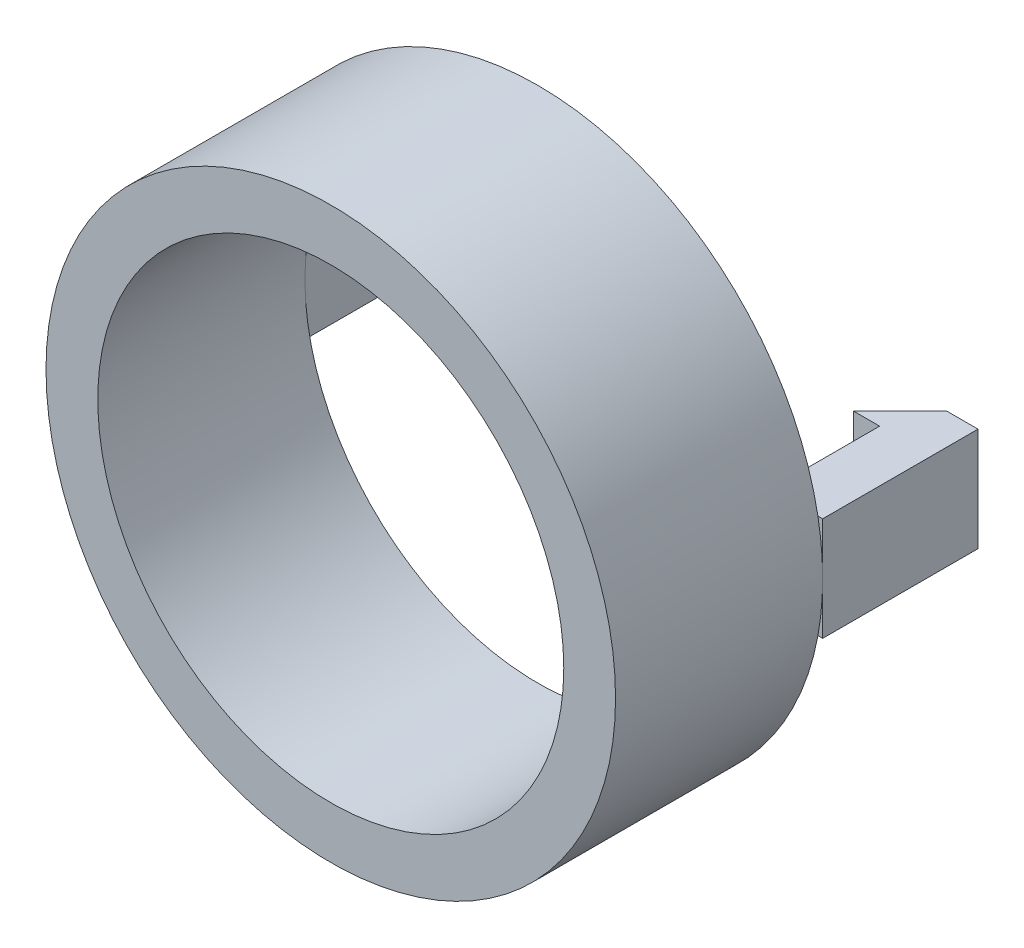
ISO-10303-21;
HEADER;
FILE_DESCRIPTION(('STEP AP214'),'2;1');
FILE_NAME('part.step','',(''),(''),'','','');
FILE_SCHEMA(('AUTOMOTIVE_DESIGN { 1 0 10303 214 1 1 1 1 }'));
ENDSEC;
DATA;
#1=APPLICATION_CONTEXT('core data for automotive mechanical design processes');
#2=APPLICATION_PROTOCOL_DEFINITION('international standard','automotive_design',2000,#1);
#3=PRODUCT_CONTEXT('',#1,'mechanical');
#4=PRODUCT('Part','Part','',(#3));
#5=PRODUCT_RELATED_PRODUCT_CATEGORY('part','',(#4));
#6=PRODUCT_DEFINITION_FORMATION('','',#4);
#7=PRODUCT_DEFINITION_CONTEXT('part definition',#1,'design');
#8=PRODUCT_DEFINITION('design','',#6,#7);
#9=PRODUCT_DEFINITION_SHAPE('','',#8);
#10=(LENGTH_UNIT() NAMED_UNIT(*) SI_UNIT(.MILLI.,.METRE.));
#11=(NAMED_UNIT(*) PLANE_ANGLE_UNIT() SI_UNIT($,.RADIAN.));
#12=(NAMED_UNIT(*) SI_UNIT($,.STERADIAN.) SOLID_ANGLE_UNIT());
#13=UNCERTAINTY_MEASURE_WITH_UNIT(LENGTH_MEASURE(1.E-05),#10,'distance_accuracy_value','');
#14=(GEOMETRIC_REPRESENTATION_CONTEXT(3) GLOBAL_UNCERTAINTY_ASSIGNED_CONTEXT((#13)) GLOBAL_UNIT_ASSIGNED_CONTEXT((#10,
#11,#12)) REPRESENTATION_CONTEXT('',''));
#15=CARTESIAN_POINT('',(0.,0.,0.));
#16=DIRECTION('',(0.,0.,1.));
#17=DIRECTION('',(1.,0.,0.));
#18=AXIS2_PLACEMENT_3D('',#15,#16,#17);
#19=CARTESIAN_POINT('',(0.,0.,0.));
#20=DIRECTION('',(0.,0.,1.));
#21=DIRECTION('',(1.,0.,0.));
#22=AXIS2_PLACEMENT_3D('',#19,#20,#21);
#23=PLANE('',#22);
#24=DIRECTION('',(0.,-1.,0.));
#25=VECTOR('',#24,1.);
#26=CARTESIAN_POINT('',(9.,2.,0.));
#27=LINE('',#26,#25);
#28=CARTESIAN_POINT('',(9.,0.,0.));
#29=VERTEX_POINT('',#28);
#30=CARTESIAN_POINT('',(9.,-2.,0.));
#31=VERTEX_POINT('',#30);
#32=EDGE_CURVE('E176',#29,#31,#27,.T.);
#33=ORIENTED_EDGE('',*,*,#32,.T.);
#34=DIRECTION('',(1.,0.,0.));
#35=VECTOR('',#34,1.);
#36=CARTESIAN_POINT('',(9.,-2.,0.));
#37=LINE('',#36,#35);
#38=CARTESIAN_POINT('',(10.816653826392,-2.,0.));
#39=VERTEX_POINT('',#38);
#40=EDGE_CURVE('E206',#31,#39,#37,.T.);
#41=ORIENTED_EDGE('',*,*,#40,.T.);
#42=CARTESIAN_POINT('',(0.,0.,0.));
#43=DIRECTION('',(0.,0.,1.));
#44=DIRECTION('',(1.,0.,0.));
#45=AXIS2_PLACEMENT_3D('',#42,#43,#44);
#46=CIRCLE('',#45,11.);
#47=CARTESIAN_POINT('',(-10.816653826392,-2.,0.));
#48=VERTEX_POINT('',#47);
#49=EDGE_CURVE('E326',#48,#39,#46,.T.);
#50=ORIENTED_EDGE('',*,*,#49,.F.);
#51=DIRECTION('',(1.,0.,0.));
#52=VECTOR('',#51,1.);
#53=CARTESIAN_POINT('',(-9.,-2.,0.));
#54=LINE('',#53,#52);
#55=CARTESIAN_POINT('',(-9.,-2.,0.));
#56=VERTEX_POINT('',#55);
#57=EDGE_CURVE('E11',#48,#56,#54,.T.);
#58=ORIENTED_EDGE('',*,*,#57,.T.);
#59=DIRECTION('',(0.,-1.,0.));
#60=VECTOR('',#59,1.);
#61=CARTESIAN_POINT('',(-9.,2.,0.));
#62=LINE('',#61,#60);
#63=CARTESIAN_POINT('',(-9.,0.,0.));
#64=VERTEX_POINT('',#63);
#65=EDGE_CURVE('E49',#64,#56,#62,.T.);
#66=ORIENTED_EDGE('',*,*,#65,.F.);
#67=CARTESIAN_POINT('',(0.,0.,0.));
#68=DIRECTION('',(0.,0.,1.));
#69=DIRECTION('',(1.,0.,0.));
#70=AXIS2_PLACEMENT_3D('',#67,#68,#69);
#71=CIRCLE('',#70,9.);
#72=EDGE_CURVE('E309',#64,#29,#71,.T.);
#73=ORIENTED_EDGE('',*,*,#72,.T.);
#74=EDGE_LOOP('',(#33,#41,#50,#58,#66,#73));
#75=FACE_BOUND('',#74,.T.);
#76=ADVANCED_FACE('F39',(#75),#23,.F.);
#77=CARTESIAN_POINT('',(0.,0.,8.));
#78=DIRECTION('',(0.,0.,1.));
#79=DIRECTION('',(1.,0.,0.));
#80=AXIS2_PLACEMENT_3D('',#77,#78,#79);
#81=PLANE('',#80);
#82=CARTESIAN_POINT('',(0.,0.,8.));
#83=DIRECTION('',(0.,0.,1.));
#84=DIRECTION('',(1.,0.,0.));
#85=AXIS2_PLACEMENT_3D('',#82,#83,#84);
#86=CIRCLE('',#85,11.);
#87=CARTESIAN_POINT('',(11.,0.,8.));
#88=VERTEX_POINT('',#87);
#89=EDGE_CURVE('E312',#88,#88,#86,.T.);
#90=ORIENTED_EDGE('',*,*,#89,.T.);
#91=EDGE_LOOP('',(#90));
#92=FACE_BOUND('',#91,.T.);
#93=CARTESIAN_POINT('',(0.,0.,8.));
#94=DIRECTION('',(0.,0.,1.));
#95=DIRECTION('',(1.,0.,0.));
#96=AXIS2_PLACEMENT_3D('',#93,#94,#95);
#97=CIRCLE('',#96,9.);
#98=CARTESIAN_POINT('',(9.,0.,8.));
#99=VERTEX_POINT('',#98);
#100=EDGE_CURVE('E305',#99,#99,#97,.T.);
#101=ORIENTED_EDGE('',*,*,#100,.F.);
#102=EDGE_LOOP('',(#101));
#103=FACE_BOUND('',#102,.T.);
#104=ADVANCED_FACE('F370',(#92,#103),#81,.T.);
#105=CARTESIAN_POINT('',(10.816653826392,2.,0.));
#106=VERTEX_POINT('',#105);
#107=CARTESIAN_POINT('',(-10.816653826392,2.,0.));
#108=VERTEX_POINT('',#107);
#109=EDGE_CURVE('E184',#106,#108,#46,.T.);
#110=ORIENTED_EDGE('',*,*,#109,.F.);
#111=DIRECTION('',(1.,0.,0.));
#112=VECTOR('',#111,1.);
#113=CARTESIAN_POINT('',(9.,2.,0.));
#114=LINE('',#113,#112);
#115=CARTESIAN_POINT('',(9.,2.,0.));
#116=VERTEX_POINT('',#115);
#117=EDGE_CURVE('E160',#116,#106,#114,.T.);
#118=ORIENTED_EDGE('',*,*,#117,.F.);
#119=EDGE_CURVE('E172',#116,#29,#27,.T.);
#120=ORIENTED_EDGE('',*,*,#119,.T.);
#121=EDGE_CURVE('E304',#29,#64,#71,.T.);
#122=ORIENTED_EDGE('',*,*,#121,.T.);
#123=CARTESIAN_POINT('',(-9.,2.,0.));
#124=VERTEX_POINT('',#123);
#125=EDGE_CURVE('E300',#124,#64,#62,.T.);
#126=ORIENTED_EDGE('',*,*,#125,.F.);
#127=DIRECTION('',(1.,0.,0.));
#128=VECTOR('',#127,1.);
#129=CARTESIAN_POINT('',(-9.,2.,0.));
#130=LINE('',#129,#128);
#131=EDGE_CURVE('E247',#108,#124,#130,.T.);
#132=ORIENTED_EDGE('',*,*,#131,.F.);
#133=EDGE_LOOP('',(#110,#118,#120,#122,#126,#132));
#134=FACE_BOUND('',#133,.T.);
#135=ADVANCED_FACE('F182',(#134),#23,.F.);
#136=CARTESIAN_POINT('',(0.,0.,8.));
#137=DIRECTION('',(0.,0.,-1.));
#138=DIRECTION('',(-1.,0.,0.));
#139=AXIS2_PLACEMENT_3D('',#136,#137,#138);
#140=CYLINDRICAL_SURFACE('',#139,11.);
#141=ORIENTED_EDGE('',*,*,#89,.F.);
#142=EDGE_LOOP('',(#141));
#143=FACE_BOUND('',#142,.T.);
#144=CARTESIAN_POINT('',(-11.,0.,0.));
#145=VERTEX_POINT('',#144);
#146=EDGE_CURVE('E43',#108,#145,#46,.T.);
#147=ORIENTED_EDGE('',*,*,#146,.T.);
#148=EDGE_CURVE('E320',#145,#48,#46,.T.);
#149=ORIENTED_EDGE('',*,*,#148,.T.);
#150=ORIENTED_EDGE('',*,*,#49,.T.);
#151=CARTESIAN_POINT('',(0.,0.,0.));
#152=DIRECTION('',(0.,0.,-1.));
#153=DIRECTION('',(-1.,0.,0.));
#154=AXIS2_PLACEMENT_3D('',#151,#152,#153);
#155=CIRCLE('',#154,11.);
#156=CARTESIAN_POINT('',(11.,0.,0.));
#157=VERTEX_POINT('',#156);
#158=EDGE_CURVE('E180',#157,#39,#155,.T.);
#159=ORIENTED_EDGE('',*,*,#158,.F.);
#160=EDGE_CURVE('E240',#106,#157,#155,.T.);
#161=ORIENTED_EDGE('',*,*,#160,.F.);
#162=ORIENTED_EDGE('',*,*,#109,.T.);
#163=EDGE_LOOP('',(#147,#149,#150,#159,#161,#162));
#164=FACE_BOUND('',#163,.T.);
#165=ADVANCED_FACE('F41',(#143,#164),#140,.T.);
#166=CARTESIAN_POINT('',(0.,0.,8.));
#167=DIRECTION('',(0.,0.,-1.));
#168=DIRECTION('',(-1.,0.,0.));
#169=AXIS2_PLACEMENT_3D('',#166,#167,#168);
#170=CYLINDRICAL_SURFACE('',#169,9.);
#171=ORIENTED_EDGE('',*,*,#100,.T.);
#172=EDGE_LOOP('',(#171));
#173=FACE_BOUND('',#172,.T.);
#174=ORIENTED_EDGE('',*,*,#72,.F.);
#175=ORIENTED_EDGE('',*,*,#121,.F.);
#176=EDGE_LOOP('',(#174,#175));
#177=FACE_BOUND('',#176,.T.);
#178=ADVANCED_FACE('F379',(#173,#177),#170,.F.);
#179=CARTESIAN_POINT('',(-9.,2.,0.));
#180=DIRECTION('',(0.,0.,-1.));
#181=DIRECTION('',(-1.,0.,0.));
#182=AXIS2_PLACEMENT_3D('',#179,#180,#181);
#183=PLANE('',#182);
#184=ORIENTED_EDGE('',*,*,#146,.F.);
#185=CARTESIAN_POINT('',(-11.,2.,0.));
#186=VERTEX_POINT('',#185);
#187=EDGE_CURVE('E241',#186,#108,#130,.T.);
#188=ORIENTED_EDGE('',*,*,#187,.F.);
#189=DIRECTION('',(0.,-1.,0.));
#190=VECTOR('',#189,1.);
#191=CARTESIAN_POINT('',(-11.,2.,0.));
#192=LINE('',#191,#190);
#193=EDGE_CURVE('E280',#186,#145,#192,.T.);
#194=ORIENTED_EDGE('',*,*,#193,.T.);
#195=EDGE_LOOP('',(#184,#188,#194));
#196=FACE_BOUND('',#195,.T.);
#197=ADVANCED_FACE('F384',(#196),#183,.F.);
#198=ORIENTED_EDGE('',*,*,#148,.F.);
#199=CARTESIAN_POINT('',(-11.,-2.,0.));
#200=VERTEX_POINT('',#199);
#201=EDGE_CURVE('E261',#145,#200,#192,.T.);
#202=ORIENTED_EDGE('',*,*,#201,.T.);
#203=EDGE_CURVE('E51',#200,#48,#54,.T.);
#204=ORIENTED_EDGE('',*,*,#203,.T.);
#205=EDGE_LOOP('',(#198,#202,#204));
#206=FACE_BOUND('',#205,.T.);
#207=ADVANCED_FACE('F390',(#206),#183,.F.);
#208=CARTESIAN_POINT('',(-9.,2.,-4.2));
#209=DIRECTION('',(-1.,0.,0.));
#210=DIRECTION('',(0.,0.,1.));
#211=AXIS2_PLACEMENT_3D('',#208,#209,#210);
#212=PLANE('',#211);
#213=DIRECTION('',(0.,0.,-1.));
#214=VECTOR('',#213,1.);
#215=CARTESIAN_POINT('',(-9.,-2.,-4.2));
#216=LINE('',#215,#214);
#217=CARTESIAN_POINT('',(-9.,-2.,-4.2));
#218=VERTEX_POINT('',#217);
#219=EDGE_CURVE('E265',#56,#218,#216,.T.);
#220=ORIENTED_EDGE('',*,*,#219,.T.);
#221=DIRECTION('',(0.,-1.,0.));
#222=VECTOR('',#221,1.);
#223=CARTESIAN_POINT('',(-9.,2.,-4.2));
#224=LINE('',#223,#222);
#225=CARTESIAN_POINT('',(-9.,2.,-4.2));
#226=VERTEX_POINT('',#225);
#227=EDGE_CURVE('E296',#226,#218,#224,.T.);
#228=ORIENTED_EDGE('',*,*,#227,.F.);
#229=DIRECTION('',(0.,0.,-1.));
#230=VECTOR('',#229,1.);
#231=CARTESIAN_POINT('',(-9.,2.,-4.2));
#232=LINE('',#231,#230);
#233=EDGE_CURVE('E245',#124,#226,#232,.T.);
#234=ORIENTED_EDGE('',*,*,#233,.F.);
#235=ORIENTED_EDGE('',*,*,#125,.T.);
#236=ORIENTED_EDGE('',*,*,#65,.T.);
#237=EDGE_LOOP('',(#220,#228,#234,#235,#236));
#238=FACE_BOUND('',#237,.T.);
#239=ADVANCED_FACE('F396',(#238),#212,.F.);
#240=CARTESIAN_POINT('',(-8.,2.,-4.2));
#241=DIRECTION('',(0.,0.,-1.));
#242=DIRECTION('',(-1.,0.,0.));
#243=AXIS2_PLACEMENT_3D('',#240,#241,#242);
#244=PLANE('',#243);
#245=DIRECTION('',(1.,0.,0.));
#246=VECTOR('',#245,1.);
#247=CARTESIAN_POINT('',(-8.,-2.,-4.2));
#248=LINE('',#247,#246);
#249=CARTESIAN_POINT('',(-8.,-2.,-4.2));
#250=VERTEX_POINT('',#249);
#251=EDGE_CURVE('E268',#218,#250,#248,.T.);
#252=ORIENTED_EDGE('',*,*,#251,.T.);
#253=DIRECTION('',(0.,-1.,0.));
#254=VECTOR('',#253,1.);
#255=CARTESIAN_POINT('',(-8.,2.,-4.2));
#256=LINE('',#255,#254);
#257=CARTESIAN_POINT('',(-8.,2.,-4.2));
#258=VERTEX_POINT('',#257);
#259=EDGE_CURVE('E292',#258,#250,#256,.T.);
#260=ORIENTED_EDGE('',*,*,#259,.F.);
#261=DIRECTION('',(1.,0.,0.));
#262=VECTOR('',#261,1.);
#263=CARTESIAN_POINT('',(-8.,2.,-4.2));
#264=LINE('',#263,#262);
#265=EDGE_CURVE('E250',#226,#258,#264,.T.);
#266=ORIENTED_EDGE('',*,*,#265,.F.);
#267=ORIENTED_EDGE('',*,*,#227,.T.);
#268=EDGE_LOOP('',(#252,#260,#266,#267));
#269=FACE_BOUND('',#268,.T.);
#270=ADVANCED_FACE('F400',(#269),#244,.F.);
#271=CARTESIAN_POINT('',(-9.80000000000002,2.,-6.));
#272=DIRECTION('',(-0.707106781186543,0.,0.707106781186552));
#273=DIRECTION('',(0.707106781186552,0.,0.707106781186543));
#274=AXIS2_PLACEMENT_3D('',#271,#272,#273);
#275=PLANE('',#274);
#276=DIRECTION('',(-0.707106781186552,0.,-0.707106781186543));
#277=VECTOR('',#276,1.);
#278=CARTESIAN_POINT('',(-9.80000000000002,-2.,-6.));
#279=LINE('',#278,#277);
#280=CARTESIAN_POINT('',(-9.80000000000002,-2.,-6.));
#281=VERTEX_POINT('',#280);
#282=EDGE_CURVE('E271',#250,#281,#279,.T.);
#283=ORIENTED_EDGE('',*,*,#282,.T.);
#284=DIRECTION('',(0.,-1.,0.));
#285=VECTOR('',#284,1.);
#286=CARTESIAN_POINT('',(-9.80000000000002,2.,-6.));
#287=LINE('',#286,#285);
#288=CARTESIAN_POINT('',(-9.80000000000002,2.,-6.));
#289=VERTEX_POINT('',#288);
#290=EDGE_CURVE('E288',#289,#281,#287,.T.);
#291=ORIENTED_EDGE('',*,*,#290,.F.);
#292=DIRECTION('',(-0.707106781186552,0.,-0.707106781186543));
#293=VECTOR('',#292,1.);
#294=CARTESIAN_POINT('',(-9.80000000000002,2.,-6.));
#295=LINE('',#294,#293);
#296=EDGE_CURVE('E253',#258,#289,#295,.T.);
#297=ORIENTED_EDGE('',*,*,#296,.F.);
#298=ORIENTED_EDGE('',*,*,#259,.T.);
#299=EDGE_LOOP('',(#283,#291,#297,#298));
#300=FACE_BOUND('',#299,.T.);
#301=ADVANCED_FACE('F404',(#300),#275,.F.);
#302=CARTESIAN_POINT('',(-11.,2.,-6.));
#303=DIRECTION('',(0.,0.,1.));
#304=DIRECTION('',(1.,0.,0.));
#305=AXIS2_PLACEMENT_3D('',#302,#303,#304);
#306=PLANE('',#305);
#307=DIRECTION('',(-1.,0.,0.));
#308=VECTOR('',#307,1.);
#309=CARTESIAN_POINT('',(-11.,-2.,-6.));
#310=LINE('',#309,#308);
#311=CARTESIAN_POINT('',(-11.,-2.,-6.));
#312=VERTEX_POINT('',#311);
#313=EDGE_CURVE('E274',#281,#312,#310,.T.);
#314=ORIENTED_EDGE('',*,*,#313,.T.);
#315=DIRECTION('',(0.,-1.,0.));
#316=VECTOR('',#315,1.);
#317=CARTESIAN_POINT('',(-11.,2.,-6.));
#318=LINE('',#317,#316);
#319=CARTESIAN_POINT('',(-11.,2.,-6.));
#320=VERTEX_POINT('',#319);
#321=EDGE_CURVE('E284',#320,#312,#318,.T.);
#322=ORIENTED_EDGE('',*,*,#321,.F.);
#323=DIRECTION('',(-1.,0.,0.));
#324=VECTOR('',#323,1.);
#325=CARTESIAN_POINT('',(-11.,2.,-6.));
#326=LINE('',#325,#324);
#327=EDGE_CURVE('E256',#289,#320,#326,.T.);
#328=ORIENTED_EDGE('',*,*,#327,.F.);
#329=ORIENTED_EDGE('',*,*,#290,.T.);
#330=EDGE_LOOP('',(#314,#322,#328,#329));
#331=FACE_BOUND('',#330,.T.);
#332=ADVANCED_FACE('F408',(#331),#306,.F.);
#333=CARTESIAN_POINT('',(-11.,2.,0.));
#334=DIRECTION('',(1.,0.,0.));
#335=DIRECTION('',(0.,0.,-1.));
#336=AXIS2_PLACEMENT_3D('',#333,#334,#335);
#337=PLANE('',#336);
#338=DIRECTION('',(0.,0.,1.));
#339=VECTOR('',#338,1.);
#340=CARTESIAN_POINT('',(-11.,-2.,0.));
#341=LINE('',#340,#339);
#342=EDGE_CURVE('E246',#312,#200,#341,.T.);
#343=ORIENTED_EDGE('',*,*,#342,.T.);
#344=ORIENTED_EDGE('',*,*,#201,.F.);
#345=ORIENTED_EDGE('',*,*,#193,.F.);
#346=DIRECTION('',(0.,0.,1.));
#347=VECTOR('',#346,1.);
#348=CARTESIAN_POINT('',(-11.,2.,0.));
#349=LINE('',#348,#347);
#350=EDGE_CURVE('E259',#320,#186,#349,.T.);
#351=ORIENTED_EDGE('',*,*,#350,.F.);
#352=ORIENTED_EDGE('',*,*,#321,.T.);
#353=EDGE_LOOP('',(#343,#344,#345,#351,#352));
#354=FACE_BOUND('',#353,.T.);
#355=ADVANCED_FACE('F412',(#354),#337,.F.);
#356=CARTESIAN_POINT('',(0.,2.,0.));
#357=DIRECTION('',(0.,-1.,0.));
#358=DIRECTION('',(0.,0.,-1.));
#359=AXIS2_PLACEMENT_3D('',#356,#357,#358);
#360=PLANE('',#359);
#361=ORIENTED_EDGE('',*,*,#187,.T.);
#362=ORIENTED_EDGE('',*,*,#131,.T.);
#363=ORIENTED_EDGE('',*,*,#233,.T.);
#364=ORIENTED_EDGE('',*,*,#265,.T.);
#365=ORIENTED_EDGE('',*,*,#296,.T.);
#366=ORIENTED_EDGE('',*,*,#327,.T.);
#367=ORIENTED_EDGE('',*,*,#350,.T.);
#368=EDGE_LOOP('',(#361,#362,#363,#364,#365,#366,#367));
#369=FACE_BOUND('',#368,.T.);
#370=ADVANCED_FACE('F416',(#369),#360,.F.);
#371=CARTESIAN_POINT('',(0.,-2.,0.));
#372=DIRECTION('',(0.,-1.,0.));
#373=DIRECTION('',(0.,0.,-1.));
#374=AXIS2_PLACEMENT_3D('',#371,#372,#373);
#375=PLANE('',#374);
#376=ORIENTED_EDGE('',*,*,#203,.F.);
#377=ORIENTED_EDGE('',*,*,#342,.F.);
#378=ORIENTED_EDGE('',*,*,#313,.F.);
#379=ORIENTED_EDGE('',*,*,#282,.F.);
#380=ORIENTED_EDGE('',*,*,#251,.F.);
#381=ORIENTED_EDGE('',*,*,#219,.F.);
#382=ORIENTED_EDGE('',*,*,#57,.F.);
#383=EDGE_LOOP('',(#376,#377,#378,#379,#380,#381,#382));
#384=FACE_BOUND('',#383,.T.);
#385=ADVANCED_FACE('F367',(#384),#375,.T.);
#386=CARTESIAN_POINT('',(9.,2.,0.));
#387=DIRECTION('',(0.,0.,-1.));
#388=DIRECTION('',(-1.,0.,0.));
#389=AXIS2_PLACEMENT_3D('',#386,#387,#388);
#390=PLANE('',#389);
#391=CARTESIAN_POINT('',(11.,2.,0.));
#392=VERTEX_POINT('',#391);
#393=EDGE_CURVE('E168',#106,#392,#114,.T.);
#394=ORIENTED_EDGE('',*,*,#393,.F.);
#395=ORIENTED_EDGE('',*,*,#160,.T.);
#396=DIRECTION('',(0.,-1.,0.));
#397=VECTOR('',#396,1.);
#398=CARTESIAN_POINT('',(11.,2.,0.));
#399=LINE('',#398,#397);
#400=EDGE_CURVE('E58',#392,#157,#399,.T.);
#401=ORIENTED_EDGE('',*,*,#400,.F.);
#402=EDGE_LOOP('',(#394,#395,#401));
#403=FACE_BOUND('',#402,.T.);
#404=ADVANCED_FACE('F359',(#403),#390,.F.);
#405=CARTESIAN_POINT('',(9.,2.,-4.2));
#406=DIRECTION('',(1.,0.,0.));
#407=DIRECTION('',(0.,0.,-1.));
#408=AXIS2_PLACEMENT_3D('',#405,#406,#407);
#409=PLANE('',#408);
#410=DIRECTION('',(0.,0.,1.));
#411=VECTOR('',#410,1.);
#412=CARTESIAN_POINT('',(9.,-2.,-4.2));
#413=LINE('',#412,#411);
#414=CARTESIAN_POINT('',(9.,-2.,-4.2));
#415=VERTEX_POINT('',#414);
#416=EDGE_CURVE('E202',#415,#31,#413,.T.);
#417=ORIENTED_EDGE('',*,*,#416,.T.);
#418=ORIENTED_EDGE('',*,*,#32,.F.);
#419=ORIENTED_EDGE('',*,*,#119,.F.);
#420=DIRECTION('',(0.,0.,1.));
#421=VECTOR('',#420,1.);
#422=CARTESIAN_POINT('',(9.,2.,-4.2));
#423=LINE('',#422,#421);
#424=CARTESIAN_POINT('',(9.,2.,-4.2));
#425=VERTEX_POINT('',#424);
#426=EDGE_CURVE('E156',#425,#116,#423,.T.);
#427=ORIENTED_EDGE('',*,*,#426,.F.);
#428=DIRECTION('',(0.,-1.,0.));
#429=VECTOR('',#428,1.);
#430=CARTESIAN_POINT('',(9.,2.,-4.2));
#431=LINE('',#430,#429);
#432=EDGE_CURVE('E201',#425,#415,#431,.T.);
#433=ORIENTED_EDGE('',*,*,#432,.T.);
#434=EDGE_LOOP('',(#417,#418,#419,#427,#433));
#435=FACE_BOUND('',#434,.T.);
#436=ADVANCED_FACE('F174',(#435),#409,.F.);
#437=CARTESIAN_POINT('',(11.,-2.,0.));
#438=VERTEX_POINT('',#437);
#439=EDGE_CURVE('E235',#157,#438,#399,.T.);
#440=ORIENTED_EDGE('',*,*,#439,.F.);
#441=ORIENTED_EDGE('',*,*,#158,.T.);
#442=EDGE_CURVE('E205',#39,#438,#37,.T.);
#443=ORIENTED_EDGE('',*,*,#442,.T.);
#444=EDGE_LOOP('',(#440,#441,#443));
#445=FACE_BOUND('',#444,.T.);
#446=ADVANCED_FACE('F355',(#445),#390,.F.);
#447=CARTESIAN_POINT('',(11.,2.,0.));
#448=DIRECTION('',(-1.,0.,0.));
#449=DIRECTION('',(0.,0.,1.));
#450=AXIS2_PLACEMENT_3D('',#447,#448,#449);
#451=PLANE('',#450);
#452=DIRECTION('',(0.,0.,-1.));
#453=VECTOR('',#452,1.);
#454=CARTESIAN_POINT('',(11.,-2.,0.));
#455=LINE('',#454,#453);
#456=CARTESIAN_POINT('',(11.,-2.,-6.));
#457=VERTEX_POINT('',#456);
#458=EDGE_CURVE('E210',#438,#457,#455,.T.);
#459=ORIENTED_EDGE('',*,*,#458,.T.);
#460=DIRECTION('',(0.,-1.,0.));
#461=VECTOR('',#460,1.);
#462=CARTESIAN_POINT('',(11.,2.,-6.));
#463=LINE('',#462,#461);
#464=CARTESIAN_POINT('',(11.,2.,-6.));
#465=VERTEX_POINT('',#464);
#466=EDGE_CURVE('E231',#465,#457,#463,.T.);
#467=ORIENTED_EDGE('',*,*,#466,.F.);
#468=DIRECTION('',(0.,0.,-1.));
#469=VECTOR('',#468,1.);
#470=CARTESIAN_POINT('',(11.,2.,0.));
#471=LINE('',#470,#469);
#472=EDGE_CURVE('E187',#392,#465,#471,.T.);
#473=ORIENTED_EDGE('',*,*,#472,.F.);
#474=ORIENTED_EDGE('',*,*,#400,.T.);
#475=ORIENTED_EDGE('',*,*,#439,.T.);
#476=EDGE_LOOP('',(#459,#467,#473,#474,#475));
#477=FACE_BOUND('',#476,.T.);
#478=ADVANCED_FACE('F351',(#477),#451,.F.);
#479=CARTESIAN_POINT('',(11.,2.,-6.));
#480=DIRECTION('',(0.,0.,1.));
#481=DIRECTION('',(1.,0.,0.));
#482=AXIS2_PLACEMENT_3D('',#479,#480,#481);
#483=PLANE('',#482);
#484=DIRECTION('',(-1.,0.,0.));
#485=VECTOR('',#484,1.);
#486=CARTESIAN_POINT('',(11.,-2.,-6.));
#487=LINE('',#486,#485);
#488=CARTESIAN_POINT('',(9.80000000000002,-2.,-6.));
#489=VERTEX_POINT('',#488);
#490=EDGE_CURVE('E213',#457,#489,#487,.T.);
#491=ORIENTED_EDGE('',*,*,#490,.T.);
#492=DIRECTION('',(0.,-1.,0.));
#493=VECTOR('',#492,1.);
#494=CARTESIAN_POINT('',(9.80000000000002,2.,-6.));
#495=LINE('',#494,#493);
#496=CARTESIAN_POINT('',(9.80000000000002,2.,-6.));
#497=VERTEX_POINT('',#496);
#498=EDGE_CURVE('E227',#497,#489,#495,.T.);
#499=ORIENTED_EDGE('',*,*,#498,.F.);
#500=DIRECTION('',(-1.,0.,0.));
#501=VECTOR('',#500,1.);
#502=CARTESIAN_POINT('',(11.,2.,-6.));
#503=LINE('',#502,#501);
#504=EDGE_CURVE('E191',#465,#497,#503,.T.);
#505=ORIENTED_EDGE('',*,*,#504,.F.);
#506=ORIENTED_EDGE('',*,*,#466,.T.);
#507=EDGE_LOOP('',(#491,#499,#505,#506));
#508=FACE_BOUND('',#507,.T.);
#509=ADVANCED_FACE('F349',(#508),#483,.F.);
#510=CARTESIAN_POINT('',(9.80000000000002,2.,-6.));
#511=DIRECTION('',(0.707106781186543,0.,0.707106781186552));
#512=DIRECTION('',(0.707106781186552,0.,-0.707106781186543));
#513=AXIS2_PLACEMENT_3D('',#510,#511,#512);
#514=PLANE('',#513);
#515=DIRECTION('',(-0.707106781186552,0.,0.707106781186543));
#516=VECTOR('',#515,1.);
#517=CARTESIAN_POINT('',(9.80000000000002,-2.,-6.));
#518=LINE('',#517,#516);
#519=CARTESIAN_POINT('',(8.,-2.,-4.2));
#520=VERTEX_POINT('',#519);
#521=EDGE_CURVE('E216',#489,#520,#518,.T.);
#522=ORIENTED_EDGE('',*,*,#521,.T.);
#523=DIRECTION('',(0.,-1.,0.));
#524=VECTOR('',#523,1.);
#525=CARTESIAN_POINT('',(8.,2.,-4.2));
#526=LINE('',#525,#524);
#527=CARTESIAN_POINT('',(8.,2.,-4.2));
#528=VERTEX_POINT('',#527);
#529=EDGE_CURVE('E223',#528,#520,#526,.T.);
#530=ORIENTED_EDGE('',*,*,#529,.F.);
#531=DIRECTION('',(-0.707106781186552,0.,0.707106781186543));
#532=VECTOR('',#531,1.);
#533=CARTESIAN_POINT('',(9.80000000000002,2.,-6.));
#534=LINE('',#533,#532);
#535=EDGE_CURVE('E196',#497,#528,#534,.T.);
#536=ORIENTED_EDGE('',*,*,#535,.F.);
#537=ORIENTED_EDGE('',*,*,#498,.T.);
#538=EDGE_LOOP('',(#522,#530,#536,#537));
#539=FACE_BOUND('',#538,.T.);
#540=ADVANCED_FACE('F344',(#539),#514,.F.);
#541=CARTESIAN_POINT('',(8.,2.,-4.2));
#542=DIRECTION('',(0.,0.,-1.));
#543=DIRECTION('',(-1.,0.,0.));
#544=AXIS2_PLACEMENT_3D('',#541,#542,#543);
#545=PLANE('',#544);
#546=DIRECTION('',(1.,0.,0.));
#547=VECTOR('',#546,1.);
#548=CARTESIAN_POINT('',(8.,-2.,-4.2));
#549=LINE('',#548,#547);
#550=EDGE_CURVE('E169',#520,#415,#549,.T.);
#551=ORIENTED_EDGE('',*,*,#550,.T.);
#552=ORIENTED_EDGE('',*,*,#432,.F.);
#553=DIRECTION('',(1.,0.,0.));
#554=VECTOR('',#553,1.);
#555=CARTESIAN_POINT('',(8.,2.,-4.2));
#556=LINE('',#555,#554);
#557=EDGE_CURVE('E163',#528,#425,#556,.T.);
#558=ORIENTED_EDGE('',*,*,#557,.F.);
#559=ORIENTED_EDGE('',*,*,#529,.T.);
#560=EDGE_LOOP('',(#551,#552,#558,#559));
#561=FACE_BOUND('',#560,.T.);
#562=ADVANCED_FACE('F339',(#561),#545,.F.);
#563=CARTESIAN_POINT('',(0.,2.,0.));
#564=DIRECTION('',(0.,1.,0.));
#565=DIRECTION('',(0.,0.,1.));
#566=AXIS2_PLACEMENT_3D('',#563,#564,#565);
#567=PLANE('',#566);
#568=ORIENTED_EDGE('',*,*,#426,.T.);
#569=ORIENTED_EDGE('',*,*,#117,.T.);
#570=ORIENTED_EDGE('',*,*,#393,.T.);
#571=ORIENTED_EDGE('',*,*,#472,.T.);
#572=ORIENTED_EDGE('',*,*,#504,.T.);
#573=ORIENTED_EDGE('',*,*,#535,.T.);
#574=ORIENTED_EDGE('',*,*,#557,.T.);
#575=EDGE_LOOP('',(#568,#569,#570,#571,#572,#573,#574));
#576=FACE_BOUND('',#575,.T.);
#577=ADVANCED_FACE('F158',(#576),#567,.T.);
#578=CARTESIAN_POINT('',(0.,-2.,0.));
#579=DIRECTION('',(0.,1.,0.));
#580=DIRECTION('',(0.,0.,1.));
#581=AXIS2_PLACEMENT_3D('',#578,#579,#580);
#582=PLANE('',#581);
#583=ORIENTED_EDGE('',*,*,#416,.F.);
#584=ORIENTED_EDGE('',*,*,#550,.F.);
#585=ORIENTED_EDGE('',*,*,#521,.F.);
#586=ORIENTED_EDGE('',*,*,#490,.F.);
#587=ORIENTED_EDGE('',*,*,#458,.F.);
#588=ORIENTED_EDGE('',*,*,#442,.F.);
#589=ORIENTED_EDGE('',*,*,#40,.F.);
#590=EDGE_LOOP('',(#583,#584,#585,#586,#587,#588,#589));
#591=FACE_BOUND('',#590,.T.);
#592=ADVANCED_FACE('F334',(#591),#582,.F.);
#593=CLOSED_SHELL('',(#76,#104,#135,#165,#178,#197,#207,#239,#270,#301,#332,#355,#370,#385,#404,
#436,#446,#478,#509,#540,#562,#577,#592));
#594=MANIFOLD_SOLID_BREP('B2',#593);
#595=ADVANCED_BREP_SHAPE_REPRESENTATION('',(#18,#594),#14);
#596=SHAPE_DEFINITION_REPRESENTATION(#9,#595);
ENDSEC;
END-ISO-10303-21;
